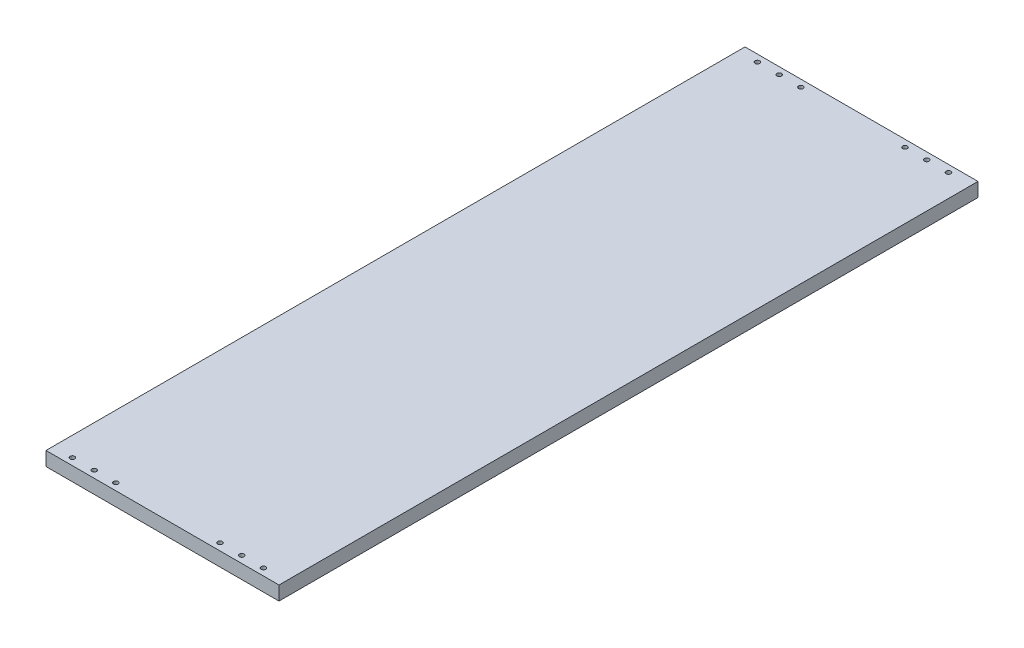
ISO-10303-21;
HEADER;
FILE_DESCRIPTION(('STEP AP214'),'2;1');
FILE_NAME('part.step','',(''),(''),'','','');
FILE_SCHEMA(('AUTOMOTIVE_DESIGN { 1 0 10303 214 1 1 1 1 }'));
ENDSEC;
DATA;
#1=APPLICATION_CONTEXT('core data for automotive mechanical design processes');
#2=APPLICATION_PROTOCOL_DEFINITION('international standard','automotive_design',2000,#1);
#3=PRODUCT_CONTEXT('',#1,'mechanical');
#4=PRODUCT('Part','Part','',(#3));
#5=PRODUCT_RELATED_PRODUCT_CATEGORY('part','',(#4));
#6=PRODUCT_DEFINITION_FORMATION('','',#4);
#7=PRODUCT_DEFINITION_CONTEXT('part definition',#1,'design');
#8=PRODUCT_DEFINITION('design','',#6,#7);
#9=PRODUCT_DEFINITION_SHAPE('','',#8);
#10=(LENGTH_UNIT() NAMED_UNIT(*) SI_UNIT(.MILLI.,.METRE.));
#11=(NAMED_UNIT(*) PLANE_ANGLE_UNIT() SI_UNIT($,.RADIAN.));
#12=(NAMED_UNIT(*) SI_UNIT($,.STERADIAN.) SOLID_ANGLE_UNIT());
#13=UNCERTAINTY_MEASURE_WITH_UNIT(LENGTH_MEASURE(1.E-05),#10,'distance_accuracy_value','');
#14=(GEOMETRIC_REPRESENTATION_CONTEXT(3) GLOBAL_UNCERTAINTY_ASSIGNED_CONTEXT((#13)) GLOBAL_UNIT_ASSIGNED_CONTEXT((#10,
#11,#12)) REPRESENTATION_CONTEXT('',''));
#15=CARTESIAN_POINT('',(0.,0.,0.));
#16=DIRECTION('',(0.,0.,1.));
#17=DIRECTION('',(1.,0.,0.));
#18=AXIS2_PLACEMENT_3D('',#15,#16,#17);
#19=CARTESIAN_POINT('',(0.,18.,0.));
#20=DIRECTION('',(1.,0.,0.));
#21=DIRECTION('',(0.,0.,-1.));
#22=AXIS2_PLACEMENT_3D('',#19,#20,#21);
#23=PLANE('',#22);
#24=DIRECTION('',(0.,0.,1.));
#25=VECTOR('',#24,1.);
#26=CARTESIAN_POINT('',(0.,0.,0.));
#27=LINE('',#26,#25);
#28=CARTESIAN_POINT('',(0.,0.,-900.));
#29=VERTEX_POINT('',#28);
#30=CARTESIAN_POINT('',(0.,0.,0.));
#31=VERTEX_POINT('',#30);
#32=EDGE_CURVE('E99',#29,#31,#27,.T.);
#33=ORIENTED_EDGE('',*,*,#32,.T.);
#34=DIRECTION('',(0.,-1.,0.));
#35=VECTOR('',#34,1.);
#36=CARTESIAN_POINT('',(0.,18.,0.));
#37=LINE('',#36,#35);
#38=CARTESIAN_POINT('',(0.,18.,0.));
#39=VERTEX_POINT('',#38);
#40=EDGE_CURVE('E11',#39,#31,#37,.T.);
#41=ORIENTED_EDGE('',*,*,#40,.F.);
#42=DIRECTION('',(0.,0.,1.));
#43=VECTOR('',#42,1.);
#44=CARTESIAN_POINT('',(0.,18.,0.));
#45=LINE('',#44,#43);
#46=CARTESIAN_POINT('',(0.,18.,-900.));
#47=VERTEX_POINT('',#46);
#48=EDGE_CURVE('E87',#47,#39,#45,.T.);
#49=ORIENTED_EDGE('',*,*,#48,.F.);
#50=DIRECTION('',(0.,-1.,0.));
#51=VECTOR('',#50,1.);
#52=CARTESIAN_POINT('',(0.,18.,-900.));
#53=LINE('',#52,#51);
#54=EDGE_CURVE('E95',#47,#29,#53,.T.);
#55=ORIENTED_EDGE('',*,*,#54,.T.);
#56=EDGE_LOOP('',(#33,#41,#49,#55));
#57=FACE_BOUND('',#56,.T.);
#58=ADVANCED_FACE('F36',(#57),#23,.F.);
#59=CARTESIAN_POINT('',(0.,18.,0.));
#60=DIRECTION('',(0.,0.,-1.));
#61=DIRECTION('',(-1.,0.,0.));
#62=AXIS2_PLACEMENT_3D('',#59,#60,#61);
#63=PLANE('',#62);
#64=DIRECTION('',(1.,0.,0.));
#65=VECTOR('',#64,1.);
#66=CARTESIAN_POINT('',(0.,0.,0.));
#67=LINE('',#66,#65);
#68=CARTESIAN_POINT('',(300.,0.,0.));
#69=VERTEX_POINT('',#68);
#70=EDGE_CURVE('E91',#31,#69,#67,.T.);
#71=ORIENTED_EDGE('',*,*,#70,.T.);
#72=DIRECTION('',(0.,-1.,0.));
#73=VECTOR('',#72,1.);
#74=CARTESIAN_POINT('',(300.,18.,0.));
#75=LINE('',#74,#73);
#76=CARTESIAN_POINT('',(300.,18.,0.));
#77=VERTEX_POINT('',#76);
#78=EDGE_CURVE('E44',#77,#69,#75,.T.);
#79=ORIENTED_EDGE('',*,*,#78,.F.);
#80=DIRECTION('',(1.,0.,0.));
#81=VECTOR('',#80,1.);
#82=CARTESIAN_POINT('',(0.,18.,0.));
#83=LINE('',#82,#81);
#84=EDGE_CURVE('E82',#39,#77,#83,.T.);
#85=ORIENTED_EDGE('',*,*,#84,.F.);
#86=ORIENTED_EDGE('',*,*,#40,.T.);
#87=EDGE_LOOP('',(#71,#79,#85,#86));
#88=FACE_BOUND('',#87,.T.);
#89=ADVANCED_FACE('F90',(#88),#63,.F.);
#90=CARTESIAN_POINT('',(300.,18.,0.));
#91=DIRECTION('',(-1.,0.,0.));
#92=DIRECTION('',(0.,0.,1.));
#93=AXIS2_PLACEMENT_3D('',#90,#91,#92);
#94=PLANE('',#93);
#95=DIRECTION('',(0.,0.,-1.));
#96=VECTOR('',#95,1.);
#97=CARTESIAN_POINT('',(300.,0.,0.));
#98=LINE('',#97,#96);
#99=CARTESIAN_POINT('',(300.,0.,-900.));
#100=VERTEX_POINT('',#99);
#101=EDGE_CURVE('E69',#69,#100,#98,.T.);
#102=ORIENTED_EDGE('',*,*,#101,.T.);
#103=DIRECTION('',(0.,-1.,0.));
#104=VECTOR('',#103,1.);
#105=CARTESIAN_POINT('',(300.,18.,-900.));
#106=LINE('',#105,#104);
#107=CARTESIAN_POINT('',(300.,18.,-900.));
#108=VERTEX_POINT('',#107);
#109=EDGE_CURVE('E92',#108,#100,#106,.T.);
#110=ORIENTED_EDGE('',*,*,#109,.F.);
#111=DIRECTION('',(0.,0.,-1.));
#112=VECTOR('',#111,1.);
#113=CARTESIAN_POINT('',(300.,18.,0.));
#114=LINE('',#113,#112);
#115=EDGE_CURVE('E85',#77,#108,#114,.T.);
#116=ORIENTED_EDGE('',*,*,#115,.F.);
#117=ORIENTED_EDGE('',*,*,#78,.T.);
#118=EDGE_LOOP('',(#102,#110,#116,#117));
#119=FACE_BOUND('',#118,.T.);
#120=ADVANCED_FACE('F93',(#119),#94,.F.);
#121=CARTESIAN_POINT('',(0.,18.,-900.));
#122=DIRECTION('',(0.,0.,1.));
#123=DIRECTION('',(1.,0.,0.));
#124=AXIS2_PLACEMENT_3D('',#121,#122,#123);
#125=PLANE('',#124);
#126=DIRECTION('',(-1.,0.,0.));
#127=VECTOR('',#126,1.);
#128=CARTESIAN_POINT('',(0.,0.,-900.));
#129=LINE('',#128,#127);
#130=EDGE_CURVE('E75',#100,#29,#129,.T.);
#131=ORIENTED_EDGE('',*,*,#130,.T.);
#132=ORIENTED_EDGE('',*,*,#54,.F.);
#133=DIRECTION('',(-1.,0.,0.));
#134=VECTOR('',#133,1.);
#135=CARTESIAN_POINT('',(0.,18.,-900.));
#136=LINE('',#135,#134);
#137=EDGE_CURVE('E52',#108,#47,#136,.T.);
#138=ORIENTED_EDGE('',*,*,#137,.F.);
#139=ORIENTED_EDGE('',*,*,#109,.T.);
#140=EDGE_LOOP('',(#131,#132,#138,#139));
#141=FACE_BOUND('',#140,.T.);
#142=ADVANCED_FACE('F107',(#141),#125,.F.);
#143=CARTESIAN_POINT('',(0.,18.,0.));
#144=DIRECTION('',(0.,-1.,0.));
#145=DIRECTION('',(0.,0.,-1.));
#146=AXIS2_PLACEMENT_3D('',#143,#144,#145);
#147=PLANE('',#146);
#148=CARTESIAN_POINT('',(215.,18.,-891.));
#149=DIRECTION('',(0.,1.,0.));
#150=DIRECTION('',(0.,0.,-1.));
#151=AXIS2_PLACEMENT_3D('',#148,#149,#150);
#152=CIRCLE('',#151,3.00000000000002);
#153=CARTESIAN_POINT('',(215.,18.,-894.));
#154=VERTEX_POINT('',#153);
#155=EDGE_CURVE('E143',#154,#154,#152,.T.);
#156=ORIENTED_EDGE('',*,*,#155,.F.);
#157=EDGE_LOOP('',(#156));
#158=FACE_BOUND('',#157,.T.);
#159=CARTESIAN_POINT('',(243.,18.,-891.));
#160=DIRECTION('',(0.,1.,0.));
#161=DIRECTION('',(0.,0.,-1.));
#162=AXIS2_PLACEMENT_3D('',#159,#160,#161);
#163=CIRCLE('',#162,2.99999999999999);
#164=CARTESIAN_POINT('',(243.,18.,-894.));
#165=VERTEX_POINT('',#164);
#166=EDGE_CURVE('E150',#165,#165,#163,.T.);
#167=ORIENTED_EDGE('',*,*,#166,.F.);
#168=EDGE_LOOP('',(#167));
#169=FACE_BOUND('',#168,.T.);
#170=CARTESIAN_POINT('',(271.,18.,-891.));
#171=DIRECTION('',(0.,1.,0.));
#172=DIRECTION('',(0.,0.,-1.));
#173=AXIS2_PLACEMENT_3D('',#170,#171,#172);
#174=CIRCLE('',#173,2.99999999999999);
#175=CARTESIAN_POINT('',(271.,18.,-894.));
#176=VERTEX_POINT('',#175);
#177=EDGE_CURVE('E156',#176,#176,#174,.T.);
#178=ORIENTED_EDGE('',*,*,#177,.F.);
#179=EDGE_LOOP('',(#178));
#180=FACE_BOUND('',#179,.T.);
#181=CARTESIAN_POINT('',(271.,18.,-9.));
#182=DIRECTION('',(0.,1.,0.));
#183=DIRECTION('',(0.,0.,1.));
#184=AXIS2_PLACEMENT_3D('',#181,#182,#183);
#185=CIRCLE('',#184,2.99999999999999);
#186=CARTESIAN_POINT('',(271.,18.,-6.00000000000001));
#187=VERTEX_POINT('',#186);
#188=EDGE_CURVE('E162',#187,#187,#185,.T.);
#189=ORIENTED_EDGE('',*,*,#188,.F.);
#190=EDGE_LOOP('',(#189));
#191=FACE_BOUND('',#190,.T.);
#192=CARTESIAN_POINT('',(243.,18.,-9.));
#193=DIRECTION('',(0.,1.,0.));
#194=DIRECTION('',(0.,0.,1.));
#195=AXIS2_PLACEMENT_3D('',#192,#193,#194);
#196=CIRCLE('',#195,2.99999999999999);
#197=CARTESIAN_POINT('',(243.,18.,-6.00000000000001));
#198=VERTEX_POINT('',#197);
#199=EDGE_CURVE('E119',#198,#198,#196,.T.);
#200=ORIENTED_EDGE('',*,*,#199,.F.);
#201=EDGE_LOOP('',(#200));
#202=FACE_BOUND('',#201,.T.);
#203=CARTESIAN_POINT('',(215.,18.,-9.));
#204=DIRECTION('',(0.,1.,0.));
#205=DIRECTION('',(0.,0.,1.));
#206=AXIS2_PLACEMENT_3D('',#203,#204,#205);
#207=CIRCLE('',#206,3.00000000000002);
#208=CARTESIAN_POINT('',(215.,18.,-5.99999999999998));
#209=VERTEX_POINT('',#208);
#210=EDGE_CURVE('E126',#209,#209,#207,.T.);
#211=ORIENTED_EDGE('',*,*,#210,.F.);
#212=EDGE_LOOP('',(#211));
#213=FACE_BOUND('',#212,.T.);
#214=CARTESIAN_POINT('',(81.,18.,-9.));
#215=DIRECTION('',(0.,1.,0.));
#216=DIRECTION('',(0.,0.,1.));
#217=AXIS2_PLACEMENT_3D('',#214,#215,#216);
#218=CIRCLE('',#217,3.00000000000001);
#219=CARTESIAN_POINT('',(81.,18.,-5.99999999999999));
#220=VERTEX_POINT('',#219);
#221=EDGE_CURVE('E132',#220,#220,#218,.T.);
#222=ORIENTED_EDGE('',*,*,#221,.F.);
#223=EDGE_LOOP('',(#222));
#224=FACE_BOUND('',#223,.T.);
#225=CARTESIAN_POINT('',(53.,18.,-9.));
#226=DIRECTION('',(0.,1.,0.));
#227=DIRECTION('',(0.,0.,1.));
#228=AXIS2_PLACEMENT_3D('',#225,#226,#227);
#229=CIRCLE('',#228,2.99999999999999);
#230=CARTESIAN_POINT('',(53.,18.,-6.00000000000001));
#231=VERTEX_POINT('',#230);
#232=EDGE_CURVE('E138',#231,#231,#229,.T.);
#233=ORIENTED_EDGE('',*,*,#232,.F.);
#234=EDGE_LOOP('',(#233));
#235=FACE_BOUND('',#234,.T.);
#236=CARTESIAN_POINT('',(81.,18.,-891.));
#237=DIRECTION('',(0.,1.,0.));
#238=DIRECTION('',(0.,0.,-1.));
#239=AXIS2_PLACEMENT_3D('',#236,#237,#238);
#240=CIRCLE('',#239,3.00000000000001);
#241=CARTESIAN_POINT('',(81.,18.,-894.));
#242=VERTEX_POINT('',#241);
#243=EDGE_CURVE('E179',#242,#242,#240,.T.);
#244=ORIENTED_EDGE('',*,*,#243,.F.);
#245=EDGE_LOOP('',(#244));
#246=FACE_BOUND('',#245,.T.);
#247=CARTESIAN_POINT('',(53.,18.,-891.));
#248=DIRECTION('',(0.,1.,0.));
#249=DIRECTION('',(0.,0.,-1.));
#250=AXIS2_PLACEMENT_3D('',#247,#248,#249);
#251=CIRCLE('',#250,2.99999999999999);
#252=CARTESIAN_POINT('',(53.,18.,-894.));
#253=VERTEX_POINT('',#252);
#254=EDGE_CURVE('E173',#253,#253,#251,.T.);
#255=ORIENTED_EDGE('',*,*,#254,.F.);
#256=EDGE_LOOP('',(#255));
#257=FACE_BOUND('',#256,.T.);
#258=CARTESIAN_POINT('',(25.,18.,-891.));
#259=DIRECTION('',(0.,1.,0.));
#260=DIRECTION('',(0.,0.,-1.));
#261=AXIS2_PLACEMENT_3D('',#258,#259,#260);
#262=CIRCLE('',#261,3.);
#263=CARTESIAN_POINT('',(25.,18.,-894.));
#264=VERTEX_POINT('',#263);
#265=EDGE_CURVE('E167',#264,#264,#262,.T.);
#266=ORIENTED_EDGE('',*,*,#265,.F.);
#267=EDGE_LOOP('',(#266));
#268=FACE_BOUND('',#267,.T.);
#269=CARTESIAN_POINT('',(25.,18.,-9.));
#270=DIRECTION('',(0.,1.,0.));
#271=DIRECTION('',(0.,0.,1.));
#272=AXIS2_PLACEMENT_3D('',#269,#270,#271);
#273=CIRCLE('',#272,3.);
#274=CARTESIAN_POINT('',(25.,18.,-6.));
#275=VERTEX_POINT('',#274);
#276=EDGE_CURVE('E113',#275,#275,#273,.T.);
#277=ORIENTED_EDGE('',*,*,#276,.F.);
#278=EDGE_LOOP('',(#277));
#279=FACE_BOUND('',#278,.T.);
#280=ORIENTED_EDGE('',*,*,#48,.T.);
#281=ORIENTED_EDGE('',*,*,#84,.T.);
#282=ORIENTED_EDGE('',*,*,#115,.T.);
#283=ORIENTED_EDGE('',*,*,#137,.T.);
#284=EDGE_LOOP('',(#280,#281,#282,#283));
#285=FACE_BOUND('',#284,.T.);
#286=ADVANCED_FACE('F83',(#158,#169,#180,#191,#202,#213,#224,#235,#246,#257,#268,#279,#285),
#147,.F.);
#287=CARTESIAN_POINT('',(0.,0.,0.));
#288=DIRECTION('',(0.,-1.,0.));
#289=DIRECTION('',(0.,0.,-1.));
#290=AXIS2_PLACEMENT_3D('',#287,#288,#289);
#291=PLANE('',#290);
#292=ORIENTED_EDGE('',*,*,#32,.F.);
#293=ORIENTED_EDGE('',*,*,#130,.F.);
#294=ORIENTED_EDGE('',*,*,#101,.F.);
#295=ORIENTED_EDGE('',*,*,#70,.F.);
#296=EDGE_LOOP('',(#292,#293,#294,#295));
#297=FACE_BOUND('',#296,.T.);
#298=ADVANCED_FACE('F110',(#297),#291,.T.);
#299=CARTESIAN_POINT('',(25.,9.,-9.));
#300=DIRECTION('',(0.,1.,0.));
#301=DIRECTION('',(0.,0.,1.));
#302=AXIS2_PLACEMENT_3D('',#299,#300,#301);
#303=CYLINDRICAL_SURFACE('',#302,3.);
#304=CARTESIAN_POINT('',(25.,9.,-9.));
#305=DIRECTION('',(0.,1.,0.));
#306=DIRECTION('',(0.,0.,1.));
#307=AXIS2_PLACEMENT_3D('',#304,#305,#306);
#308=CIRCLE('',#307,3.);
#309=CARTESIAN_POINT('',(25.,9.,-6.));
#310=VERTEX_POINT('',#309);
#311=EDGE_CURVE('E102',#310,#310,#308,.T.);
#312=ORIENTED_EDGE('',*,*,#311,.F.);
#313=EDGE_LOOP('',(#312));
#314=FACE_BOUND('',#313,.T.);
#315=ORIENTED_EDGE('',*,*,#276,.T.);
#316=EDGE_LOOP('',(#315));
#317=FACE_BOUND('',#316,.T.);
#318=ADVANCED_FACE('F204',(#314,#317),#303,.F.);
#319=CARTESIAN_POINT('',(25.,9.,-9.));
#320=DIRECTION('',(0.,1.,0.));
#321=DIRECTION('',(0.,0.,1.));
#322=AXIS2_PLACEMENT_3D('',#319,#320,#321);
#323=PLANE('',#322);
#324=ORIENTED_EDGE('',*,*,#311,.T.);
#325=EDGE_LOOP('',(#324));
#326=FACE_BOUND('',#325,.T.);
#327=ADVANCED_FACE('F206',(#326),#323,.T.);
#328=CARTESIAN_POINT('',(25.,9.,-891.));
#329=DIRECTION('',(0.,1.,0.));
#330=DIRECTION('',(0.,0.,1.));
#331=AXIS2_PLACEMENT_3D('',#328,#329,#330);
#332=CYLINDRICAL_SURFACE('',#331,3.);
#333=CARTESIAN_POINT('',(25.,9.,-891.));
#334=DIRECTION('',(0.,1.,0.));
#335=DIRECTION('',(0.,0.,-1.));
#336=AXIS2_PLACEMENT_3D('',#333,#334,#335);
#337=CIRCLE('',#336,3.);
#338=CARTESIAN_POINT('',(25.,9.,-894.));
#339=VERTEX_POINT('',#338);
#340=EDGE_CURVE('E170',#339,#339,#337,.T.);
#341=ORIENTED_EDGE('',*,*,#340,.F.);
#342=EDGE_LOOP('',(#341));
#343=FACE_BOUND('',#342,.T.);
#344=ORIENTED_EDGE('',*,*,#265,.T.);
#345=EDGE_LOOP('',(#344));
#346=FACE_BOUND('',#345,.T.);
#347=ADVANCED_FACE('F213',(#343,#346),#332,.F.);
#348=CARTESIAN_POINT('',(25.,9.,-891.));
#349=DIRECTION('',(0.,-1.,0.));
#350=DIRECTION('',(0.,0.,-1.));
#351=AXIS2_PLACEMENT_3D('',#348,#349,#350);
#352=PLANE('',#351);
#353=ORIENTED_EDGE('',*,*,#340,.T.);
#354=EDGE_LOOP('',(#353));
#355=FACE_BOUND('',#354,.T.);
#356=ADVANCED_FACE('F261',(#355),#352,.F.);
#357=CARTESIAN_POINT('',(53.,9.,-891.));
#358=DIRECTION('',(0.,1.,0.));
#359=DIRECTION('',(0.,0.,1.));
#360=AXIS2_PLACEMENT_3D('',#357,#358,#359);
#361=CYLINDRICAL_SURFACE('',#360,2.99999999999999);
#362=CARTESIAN_POINT('',(53.,9.,-891.));
#363=DIRECTION('',(0.,1.,0.));
#364=DIRECTION('',(0.,0.,-1.));
#365=AXIS2_PLACEMENT_3D('',#362,#363,#364);
#366=CIRCLE('',#365,2.99999999999999);
#367=CARTESIAN_POINT('',(53.,9.,-894.));
#368=VERTEX_POINT('',#367);
#369=EDGE_CURVE('E176',#368,#368,#366,.T.);
#370=ORIENTED_EDGE('',*,*,#369,.F.);
#371=EDGE_LOOP('',(#370));
#372=FACE_BOUND('',#371,.T.);
#373=ORIENTED_EDGE('',*,*,#254,.T.);
#374=EDGE_LOOP('',(#373));
#375=FACE_BOUND('',#374,.T.);
#376=ADVANCED_FACE('F270',(#372,#375),#361,.F.);
#377=CARTESIAN_POINT('',(53.,9.,-891.));
#378=DIRECTION('',(0.,-1.,0.));
#379=DIRECTION('',(0.,0.,-1.));
#380=AXIS2_PLACEMENT_3D('',#377,#378,#379);
#381=PLANE('',#380);
#382=ORIENTED_EDGE('',*,*,#369,.T.);
#383=EDGE_LOOP('',(#382));
#384=FACE_BOUND('',#383,.T.);
#385=ADVANCED_FACE('F190',(#384),#381,.F.);
#386=CARTESIAN_POINT('',(81.,9.,-891.));
#387=DIRECTION('',(0.,1.,0.));
#388=DIRECTION('',(0.,0.,1.));
#389=AXIS2_PLACEMENT_3D('',#386,#387,#388);
#390=CYLINDRICAL_SURFACE('',#389,3.00000000000001);
#391=CARTESIAN_POINT('',(81.,9.,-891.));
#392=DIRECTION('',(0.,1.,0.));
#393=DIRECTION('',(0.,0.,-1.));
#394=AXIS2_PLACEMENT_3D('',#391,#392,#393);
#395=CIRCLE('',#394,3.00000000000001);
#396=CARTESIAN_POINT('',(81.,9.,-894.));
#397=VERTEX_POINT('',#396);
#398=EDGE_CURVE('E147',#397,#397,#395,.T.);
#399=ORIENTED_EDGE('',*,*,#398,.F.);
#400=EDGE_LOOP('',(#399));
#401=FACE_BOUND('',#400,.T.);
#402=ORIENTED_EDGE('',*,*,#243,.T.);
#403=EDGE_LOOP('',(#402));
#404=FACE_BOUND('',#403,.T.);
#405=ADVANCED_FACE('F187',(#401,#404),#390,.F.);
#406=CARTESIAN_POINT('',(81.,9.,-891.));
#407=DIRECTION('',(0.,-1.,0.));
#408=DIRECTION('',(0.,0.,-1.));
#409=AXIS2_PLACEMENT_3D('',#406,#407,#408);
#410=PLANE('',#409);
#411=ORIENTED_EDGE('',*,*,#398,.T.);
#412=EDGE_LOOP('',(#411));
#413=FACE_BOUND('',#412,.T.);
#414=ADVANCED_FACE('F185',(#413),#410,.F.);
#415=CARTESIAN_POINT('',(53.,9.,-9.));
#416=DIRECTION('',(0.,1.,0.));
#417=DIRECTION('',(0.,0.,1.));
#418=AXIS2_PLACEMENT_3D('',#415,#416,#417);
#419=CYLINDRICAL_SURFACE('',#418,2.99999999999999);
#420=CARTESIAN_POINT('',(53.,9.,-9.));
#421=DIRECTION('',(0.,1.,0.));
#422=DIRECTION('',(0.,0.,1.));
#423=AXIS2_PLACEMENT_3D('',#420,#421,#422);
#424=CIRCLE('',#423,2.99999999999999);
#425=CARTESIAN_POINT('',(53.,9.,-6.00000000000001));
#426=VERTEX_POINT('',#425);
#427=EDGE_CURVE('E116',#426,#426,#424,.T.);
#428=ORIENTED_EDGE('',*,*,#427,.F.);
#429=EDGE_LOOP('',(#428));
#430=FACE_BOUND('',#429,.T.);
#431=ORIENTED_EDGE('',*,*,#232,.T.);
#432=EDGE_LOOP('',(#431));
#433=FACE_BOUND('',#432,.T.);
#434=ADVANCED_FACE('F300',(#430,#433),#419,.F.);
#435=CARTESIAN_POINT('',(53.,9.,-9.));
#436=DIRECTION('',(0.,1.,0.));
#437=DIRECTION('',(0.,0.,1.));
#438=AXIS2_PLACEMENT_3D('',#435,#436,#437);
#439=PLANE('',#438);
#440=ORIENTED_EDGE('',*,*,#427,.T.);
#441=EDGE_LOOP('',(#440));
#442=FACE_BOUND('',#441,.T.);
#443=ADVANCED_FACE('F308',(#442),#439,.T.);
#444=CARTESIAN_POINT('',(81.,9.,-9.));
#445=DIRECTION('',(0.,1.,0.));
#446=DIRECTION('',(0.,0.,1.));
#447=AXIS2_PLACEMENT_3D('',#444,#445,#446);
#448=CYLINDRICAL_SURFACE('',#447,3.00000000000001);
#449=CARTESIAN_POINT('',(81.,9.,-9.));
#450=DIRECTION('',(0.,1.,0.));
#451=DIRECTION('',(0.,0.,1.));
#452=AXIS2_PLACEMENT_3D('',#449,#450,#451);
#453=CIRCLE('',#452,3.00000000000001);
#454=CARTESIAN_POINT('',(81.,9.,-5.99999999999999));
#455=VERTEX_POINT('',#454);
#456=EDGE_CURVE('E135',#455,#455,#453,.T.);
#457=ORIENTED_EDGE('',*,*,#456,.F.);
#458=EDGE_LOOP('',(#457));
#459=FACE_BOUND('',#458,.T.);
#460=ORIENTED_EDGE('',*,*,#221,.T.);
#461=EDGE_LOOP('',(#460));
#462=FACE_BOUND('',#461,.T.);
#463=ADVANCED_FACE('F317',(#459,#462),#448,.F.);
#464=CARTESIAN_POINT('',(81.,9.,-9.));
#465=DIRECTION('',(0.,1.,0.));
#466=DIRECTION('',(0.,0.,1.));
#467=AXIS2_PLACEMENT_3D('',#464,#465,#466);
#468=PLANE('',#467);
#469=ORIENTED_EDGE('',*,*,#456,.T.);
#470=EDGE_LOOP('',(#469));
#471=FACE_BOUND('',#470,.T.);
#472=ADVANCED_FACE('F326',(#471),#468,.T.);
#473=CARTESIAN_POINT('',(215.,9.,-9.));
#474=DIRECTION('',(0.,1.,0.));
#475=DIRECTION('',(0.,0.,1.));
#476=AXIS2_PLACEMENT_3D('',#473,#474,#475);
#477=CYLINDRICAL_SURFACE('',#476,3.00000000000002);
#478=CARTESIAN_POINT('',(215.,9.,-9.));
#479=DIRECTION('',(0.,1.,0.));
#480=DIRECTION('',(0.,0.,1.));
#481=AXIS2_PLACEMENT_3D('',#478,#479,#480);
#482=CIRCLE('',#481,3.00000000000002);
#483=CARTESIAN_POINT('',(215.,9.,-5.99999999999998));
#484=VERTEX_POINT('',#483);
#485=EDGE_CURVE('E129',#484,#484,#482,.T.);
#486=ORIENTED_EDGE('',*,*,#485,.F.);
#487=EDGE_LOOP('',(#486));
#488=FACE_BOUND('',#487,.T.);
#489=ORIENTED_EDGE('',*,*,#210,.T.);
#490=EDGE_LOOP('',(#489));
#491=FACE_BOUND('',#490,.T.);
#492=ADVANCED_FACE('F335',(#488,#491),#477,.F.);
#493=CARTESIAN_POINT('',(215.,9.,-9.));
#494=DIRECTION('',(0.,1.,0.));
#495=DIRECTION('',(0.,0.,1.));
#496=AXIS2_PLACEMENT_3D('',#493,#494,#495);
#497=PLANE('',#496);
#498=ORIENTED_EDGE('',*,*,#485,.T.);
#499=EDGE_LOOP('',(#498));
#500=FACE_BOUND('',#499,.T.);
#501=ADVANCED_FACE('F344',(#500),#497,.T.);
#502=CARTESIAN_POINT('',(243.,9.,-9.));
#503=DIRECTION('',(0.,1.,0.));
#504=DIRECTION('',(0.,0.,1.));
#505=AXIS2_PLACEMENT_3D('',#502,#503,#504);
#506=CYLINDRICAL_SURFACE('',#505,2.99999999999999);
#507=CARTESIAN_POINT('',(243.,9.,-9.));
#508=DIRECTION('',(0.,1.,0.));
#509=DIRECTION('',(0.,0.,1.));
#510=AXIS2_PLACEMENT_3D('',#507,#508,#509);
#511=CIRCLE('',#510,2.99999999999999);
#512=CARTESIAN_POINT('',(243.,9.,-6.00000000000001));
#513=VERTEX_POINT('',#512);
#514=EDGE_CURVE('E122',#513,#513,#511,.T.);
#515=ORIENTED_EDGE('',*,*,#514,.F.);
#516=EDGE_LOOP('',(#515));
#517=FACE_BOUND('',#516,.T.);
#518=ORIENTED_EDGE('',*,*,#199,.T.);
#519=EDGE_LOOP('',(#518));
#520=FACE_BOUND('',#519,.T.);
#521=ADVANCED_FACE('F353',(#517,#520),#506,.F.);
#522=CARTESIAN_POINT('',(243.,9.,-9.));
#523=DIRECTION('',(0.,1.,0.));
#524=DIRECTION('',(0.,0.,1.));
#525=AXIS2_PLACEMENT_3D('',#522,#523,#524);
#526=PLANE('',#525);
#527=ORIENTED_EDGE('',*,*,#514,.T.);
#528=EDGE_LOOP('',(#527));
#529=FACE_BOUND('',#528,.T.);
#530=ADVANCED_FACE('F362',(#529),#526,.T.);
#531=CARTESIAN_POINT('',(271.,9.,-9.));
#532=DIRECTION('',(0.,1.,0.));
#533=DIRECTION('',(0.,0.,1.));
#534=AXIS2_PLACEMENT_3D('',#531,#532,#533);
#535=CYLINDRICAL_SURFACE('',#534,2.99999999999999);
#536=CARTESIAN_POINT('',(271.,9.,-9.));
#537=DIRECTION('',(0.,1.,0.));
#538=DIRECTION('',(0.,0.,1.));
#539=AXIS2_PLACEMENT_3D('',#536,#537,#538);
#540=CIRCLE('',#539,2.99999999999999);
#541=CARTESIAN_POINT('',(271.,9.,-6.00000000000001));
#542=VERTEX_POINT('',#541);
#543=EDGE_CURVE('E123',#542,#542,#540,.T.);
#544=ORIENTED_EDGE('',*,*,#543,.F.);
#545=EDGE_LOOP('',(#544));
#546=FACE_BOUND('',#545,.T.);
#547=ORIENTED_EDGE('',*,*,#188,.T.);
#548=EDGE_LOOP('',(#547));
#549=FACE_BOUND('',#548,.T.);
#550=ADVANCED_FACE('F371',(#546,#549),#535,.F.);
#551=CARTESIAN_POINT('',(271.,9.,-9.));
#552=DIRECTION('',(0.,1.,0.));
#553=DIRECTION('',(0.,0.,1.));
#554=AXIS2_PLACEMENT_3D('',#551,#552,#553);
#555=PLANE('',#554);
#556=ORIENTED_EDGE('',*,*,#543,.T.);
#557=EDGE_LOOP('',(#556));
#558=FACE_BOUND('',#557,.T.);
#559=ADVANCED_FACE('F380',(#558),#555,.T.);
#560=CARTESIAN_POINT('',(271.,9.,-891.));
#561=DIRECTION('',(0.,1.,0.));
#562=DIRECTION('',(0.,0.,1.));
#563=AXIS2_PLACEMENT_3D('',#560,#561,#562);
#564=CYLINDRICAL_SURFACE('',#563,2.99999999999999);
#565=CARTESIAN_POINT('',(271.,9.,-891.));
#566=DIRECTION('',(0.,1.,0.));
#567=DIRECTION('',(0.,0.,-1.));
#568=AXIS2_PLACEMENT_3D('',#565,#566,#567);
#569=CIRCLE('',#568,2.99999999999999);
#570=CARTESIAN_POINT('',(271.,9.,-894.));
#571=VERTEX_POINT('',#570);
#572=EDGE_CURVE('E159',#571,#571,#569,.T.);
#573=ORIENTED_EDGE('',*,*,#572,.F.);
#574=EDGE_LOOP('',(#573));
#575=FACE_BOUND('',#574,.T.);
#576=ORIENTED_EDGE('',*,*,#177,.T.);
#577=EDGE_LOOP('',(#576));
#578=FACE_BOUND('',#577,.T.);
#579=ADVANCED_FACE('F389',(#575,#578),#564,.F.);
#580=CARTESIAN_POINT('',(271.,9.,-891.));
#581=DIRECTION('',(0.,-1.,0.));
#582=DIRECTION('',(0.,0.,-1.));
#583=AXIS2_PLACEMENT_3D('',#580,#581,#582);
#584=PLANE('',#583);
#585=ORIENTED_EDGE('',*,*,#572,.T.);
#586=EDGE_LOOP('',(#585));
#587=FACE_BOUND('',#586,.T.);
#588=ADVANCED_FACE('F398',(#587),#584,.F.);
#589=CARTESIAN_POINT('',(243.,9.,-891.));
#590=DIRECTION('',(0.,1.,0.));
#591=DIRECTION('',(0.,0.,1.));
#592=AXIS2_PLACEMENT_3D('',#589,#590,#591);
#593=CYLINDRICAL_SURFACE('',#592,2.99999999999999);
#594=CARTESIAN_POINT('',(243.,9.,-891.));
#595=DIRECTION('',(0.,1.,0.));
#596=DIRECTION('',(0.,0.,-1.));
#597=AXIS2_PLACEMENT_3D('',#594,#595,#596);
#598=CIRCLE('',#597,2.99999999999999);
#599=CARTESIAN_POINT('',(243.,9.,-894.));
#600=VERTEX_POINT('',#599);
#601=EDGE_CURVE('E153',#600,#600,#598,.T.);
#602=ORIENTED_EDGE('',*,*,#601,.F.);
#603=EDGE_LOOP('',(#602));
#604=FACE_BOUND('',#603,.T.);
#605=ORIENTED_EDGE('',*,*,#166,.T.);
#606=EDGE_LOOP('',(#605));
#607=FACE_BOUND('',#606,.T.);
#608=ADVANCED_FACE('F407',(#604,#607),#593,.F.);
#609=CARTESIAN_POINT('',(243.,9.,-891.));
#610=DIRECTION('',(0.,-1.,0.));
#611=DIRECTION('',(0.,0.,-1.));
#612=AXIS2_PLACEMENT_3D('',#609,#610,#611);
#613=PLANE('',#612);
#614=ORIENTED_EDGE('',*,*,#601,.T.);
#615=EDGE_LOOP('',(#614));
#616=FACE_BOUND('',#615,.T.);
#617=ADVANCED_FACE('F416',(#616),#613,.F.);
#618=CARTESIAN_POINT('',(215.,9.,-891.));
#619=DIRECTION('',(0.,1.,0.));
#620=DIRECTION('',(0.,0.,1.));
#621=AXIS2_PLACEMENT_3D('',#618,#619,#620);
#622=CYLINDRICAL_SURFACE('',#621,3.00000000000002);
#623=CARTESIAN_POINT('',(215.,9.,-891.));
#624=DIRECTION('',(0.,1.,0.));
#625=DIRECTION('',(0.,0.,-1.));
#626=AXIS2_PLACEMENT_3D('',#623,#624,#625);
#627=CIRCLE('',#626,3.00000000000002);
#628=CARTESIAN_POINT('',(215.,9.,-894.));
#629=VERTEX_POINT('',#628);
#630=EDGE_CURVE('E146',#629,#629,#627,.T.);
#631=ORIENTED_EDGE('',*,*,#630,.F.);
#632=EDGE_LOOP('',(#631));
#633=FACE_BOUND('',#632,.T.);
#634=ORIENTED_EDGE('',*,*,#155,.T.);
#635=EDGE_LOOP('',(#634));
#636=FACE_BOUND('',#635,.T.);
#637=ADVANCED_FACE('F425',(#633,#636),#622,.F.);
#638=CARTESIAN_POINT('',(215.,9.,-891.));
#639=DIRECTION('',(0.,-1.,0.));
#640=DIRECTION('',(0.,0.,-1.));
#641=AXIS2_PLACEMENT_3D('',#638,#639,#640);
#642=PLANE('',#641);
#643=ORIENTED_EDGE('',*,*,#630,.T.);
#644=EDGE_LOOP('',(#643));
#645=FACE_BOUND('',#644,.T.);
#646=ADVANCED_FACE('F434',(#645),#642,.F.);
#647=CLOSED_SHELL('',(#58,#89,#120,#142,#286,#298,#318,#327,#347,#356,#376,#385,#405,#414,#434,
#443,#463,#472,#492,#501,#521,#530,#550,#559,#579,#588,#608,#617,#637,#646));
#648=MANIFOLD_SOLID_BREP('B2',#647);
#649=ADVANCED_BREP_SHAPE_REPRESENTATION('',(#18,#648),#14);
#650=SHAPE_DEFINITION_REPRESENTATION(#9,#649);
ENDSEC;
END-ISO-10303-21;
